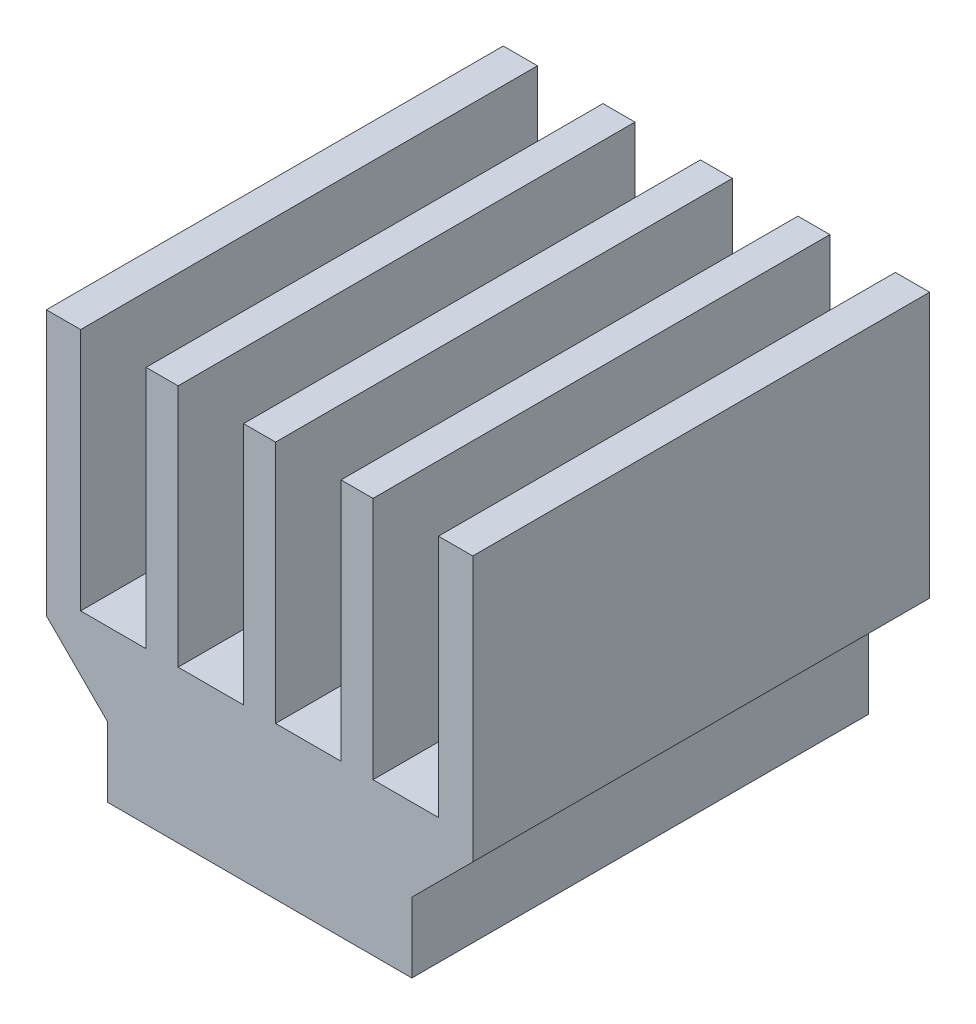
ISO-10303-21;
HEADER;
FILE_DESCRIPTION(('STEP AP214'),'2;1');
FILE_NAME('part.step','',(''),(''),'','','');
FILE_SCHEMA(('AUTOMOTIVE_DESIGN { 1 0 10303 214 1 1 1 1 }'));
ENDSEC;
DATA;
#1=APPLICATION_CONTEXT('core data for automotive mechanical design processes');
#2=APPLICATION_PROTOCOL_DEFINITION('international standard','automotive_design',2000,#1);
#3=PRODUCT_CONTEXT('',#1,'mechanical');
#4=PRODUCT('Part','Part','',(#3));
#5=PRODUCT_RELATED_PRODUCT_CATEGORY('part','',(#4));
#6=PRODUCT_DEFINITION_FORMATION('','',#4);
#7=PRODUCT_DEFINITION_CONTEXT('part definition',#1,'design');
#8=PRODUCT_DEFINITION('design','',#6,#7);
#9=PRODUCT_DEFINITION_SHAPE('','',#8);
#10=(LENGTH_UNIT() NAMED_UNIT(*) SI_UNIT(.MILLI.,.METRE.));
#11=(NAMED_UNIT(*) PLANE_ANGLE_UNIT() SI_UNIT($,.RADIAN.));
#12=(NAMED_UNIT(*) SI_UNIT($,.STERADIAN.) SOLID_ANGLE_UNIT());
#13=UNCERTAINTY_MEASURE_WITH_UNIT(LENGTH_MEASURE(1.E-05),#10,'distance_accuracy_value','');
#14=(GEOMETRIC_REPRESENTATION_CONTEXT(3) GLOBAL_UNCERTAINTY_ASSIGNED_CONTEXT((#13)) GLOBAL_UNIT_ASSIGNED_CONTEXT((#10,
#11,#12)) REPRESENTATION_CONTEXT('',''));
#15=CARTESIAN_POINT('',(0.,0.,0.));
#16=DIRECTION('',(0.,0.,1.));
#17=DIRECTION('',(1.,0.,0.));
#18=AXIS2_PLACEMENT_3D('',#15,#16,#17);
#19=CARTESIAN_POINT('',(-6.99999999999999,0.,15.0000000000001));
#20=DIRECTION('',(1.,0.,0.));
#21=DIRECTION('',(0.,1.,0.));
#22=AXIS2_PLACEMENT_3D('',#19,#20,#21);
#23=PLANE('',#22);
#24=DIRECTION('',(0.,-1.,0.));
#25=VECTOR('',#24,1.);
#26=CARTESIAN_POINT('',(-7.00000000000001,0.,0.));
#27=LINE('',#26,#25);
#28=CARTESIAN_POINT('',(-7.00000000000001,13.,0.));
#29=VERTEX_POINT('',#28);
#30=CARTESIAN_POINT('',(-7.00000000000001,4.3,0.));
#31=VERTEX_POINT('',#30);
#32=EDGE_CURVE('E229',#29,#31,#27,.T.);
#33=ORIENTED_EDGE('',*,*,#32,.T.);
#34=DIRECTION('',(0.,0.,-1.));
#35=VECTOR('',#34,1.);
#36=CARTESIAN_POINT('',(-6.99999999999999,4.3,15.));
#37=LINE('',#36,#35);
#38=CARTESIAN_POINT('',(-6.99999999999999,4.3,15.));
#39=VERTEX_POINT('',#38);
#40=EDGE_CURVE('E11',#39,#31,#37,.T.);
#41=ORIENTED_EDGE('',*,*,#40,.F.);
#42=DIRECTION('',(0.,-1.,0.));
#43=VECTOR('',#42,1.);
#44=CARTESIAN_POINT('',(-6.99999999999999,0.,15.0000000000001));
#45=LINE('',#44,#43);
#46=CARTESIAN_POINT('',(-6.99999999999999,13.,15.));
#47=VERTEX_POINT('',#46);
#48=EDGE_CURVE('E420',#47,#39,#45,.T.);
#49=ORIENTED_EDGE('',*,*,#48,.F.);
#50=DIRECTION('',(0.,0.,-1.));
#51=VECTOR('',#50,1.);
#52=CARTESIAN_POINT('',(-6.99999999999999,13.,15.));
#53=LINE('',#52,#51);
#54=EDGE_CURVE('E48',#47,#29,#53,.T.);
#55=ORIENTED_EDGE('',*,*,#54,.T.);
#56=EDGE_LOOP('',(#33,#41,#49,#55));
#57=FACE_BOUND('',#56,.T.);
#58=ADVANCED_FACE('F32',(#57),#23,.F.);
#59=CARTESIAN_POINT('',(-1.34999999999998,-1.34999999999999,15.));
#60=DIRECTION('',(0.707106781186546,0.707106781186549,0.));
#61=DIRECTION('',(-0.70710678118655,0.707106781186546,0.));
#62=AXIS2_PLACEMENT_3D('',#59,#60,#61);
#63=PLANE('',#62);
#64=DIRECTION('',(0.70710678118655,-0.707106781186546,0.));
#65=VECTOR('',#64,1.);
#66=CARTESIAN_POINT('',(-1.34999999999998,-1.34999999999999,0.));
#67=LINE('',#66,#65);
#68=CARTESIAN_POINT('',(-4.99999999999999,2.30000000000001,0.));
#69=VERTEX_POINT('',#68);
#70=EDGE_CURVE('E231',#31,#69,#67,.T.);
#71=ORIENTED_EDGE('',*,*,#70,.T.);
#72=DIRECTION('',(0.,0.,-1.));
#73=VECTOR('',#72,1.);
#74=CARTESIAN_POINT('',(-5.,2.30000000000001,15.0000000000001));
#75=LINE('',#74,#73);
#76=CARTESIAN_POINT('',(-5.,2.30000000000001,15.0000000000001));
#77=VERTEX_POINT('',#76);
#78=EDGE_CURVE('E40',#77,#69,#75,.T.);
#79=ORIENTED_EDGE('',*,*,#78,.F.);
#80=DIRECTION('',(0.70710678118655,-0.707106781186546,0.));
#81=VECTOR('',#80,1.);
#82=CARTESIAN_POINT('',(-1.34999999999998,-1.34999999999999,15.));
#83=LINE('',#82,#81);
#84=EDGE_CURVE('E134',#39,#77,#83,.T.);
#85=ORIENTED_EDGE('',*,*,#84,.F.);
#86=ORIENTED_EDGE('',*,*,#40,.T.);
#87=EDGE_LOOP('',(#71,#79,#85,#86));
#88=FACE_BOUND('',#87,.T.);
#89=ADVANCED_FACE('F423',(#88),#63,.F.);
#90=CARTESIAN_POINT('',(-5.,0.,15.0000000000001));
#91=DIRECTION('',(1.,0.,0.));
#92=DIRECTION('',(0.,1.,0.));
#93=AXIS2_PLACEMENT_3D('',#90,#91,#92);
#94=PLANE('',#93);
#95=DIRECTION('',(0.,-1.,0.));
#96=VECTOR('',#95,1.);
#97=CARTESIAN_POINT('',(-4.99999999999999,0.,0.));
#98=LINE('',#97,#96);
#99=CARTESIAN_POINT('',(-4.99999999999999,0.,0.));
#100=VERTEX_POINT('',#99);
#101=EDGE_CURVE('E233',#69,#100,#98,.T.);
#102=ORIENTED_EDGE('',*,*,#101,.T.);
#103=DIRECTION('',(0.,0.,-1.));
#104=VECTOR('',#103,1.);
#105=CARTESIAN_POINT('',(-5.,0.,15.0000000000001));
#106=LINE('',#105,#104);
#107=CARTESIAN_POINT('',(-5.,0.,15.0000000000001));
#108=VERTEX_POINT('',#107);
#109=EDGE_CURVE('E331',#108,#100,#106,.T.);
#110=ORIENTED_EDGE('',*,*,#109,.F.);
#111=DIRECTION('',(0.,-1.,0.));
#112=VECTOR('',#111,1.);
#113=CARTESIAN_POINT('',(-5.,0.,15.0000000000001));
#114=LINE('',#113,#112);
#115=EDGE_CURVE('E339',#77,#108,#114,.T.);
#116=ORIENTED_EDGE('',*,*,#115,.F.);
#117=ORIENTED_EDGE('',*,*,#78,.T.);
#118=EDGE_LOOP('',(#102,#110,#116,#117));
#119=FACE_BOUND('',#118,.T.);
#120=ADVANCED_FACE('F337',(#119),#94,.F.);
#121=CARTESIAN_POINT('',(0.,0.,15.));
#122=DIRECTION('',(0.,1.,0.));
#123=DIRECTION('',(0.,0.,1.));
#124=AXIS2_PLACEMENT_3D('',#121,#122,#123);
#125=PLANE('',#124);
#126=DIRECTION('',(1.,0.,0.));
#127=VECTOR('',#126,1.);
#128=CARTESIAN_POINT('',(0.,0.,0.));
#129=LINE('',#128,#127);
#130=CARTESIAN_POINT('',(5.00000000000003,0.,0.));
#131=VERTEX_POINT('',#130);
#132=EDGE_CURVE('E236',#100,#131,#129,.T.);
#133=ORIENTED_EDGE('',*,*,#132,.T.);
#134=DIRECTION('',(0.,0.,-1.));
#135=VECTOR('',#134,1.);
#136=CARTESIAN_POINT('',(5.,0.,15.));
#137=LINE('',#136,#135);
#138=CARTESIAN_POINT('',(5.,0.,15.));
#139=VERTEX_POINT('',#138);
#140=EDGE_CURVE('E328',#139,#131,#137,.T.);
#141=ORIENTED_EDGE('',*,*,#140,.F.);
#142=DIRECTION('',(1.,0.,0.));
#143=VECTOR('',#142,1.);
#144=CARTESIAN_POINT('',(0.,0.,15.));
#145=LINE('',#144,#143);
#146=EDGE_CURVE('E349',#108,#139,#145,.T.);
#147=ORIENTED_EDGE('',*,*,#146,.F.);
#148=ORIENTED_EDGE('',*,*,#109,.T.);
#149=EDGE_LOOP('',(#133,#141,#147,#148));
#150=FACE_BOUND('',#149,.T.);
#151=ADVANCED_FACE('F346',(#150),#125,.F.);
#152=CARTESIAN_POINT('',(5.,0.,15.));
#153=DIRECTION('',(1.,0.,0.));
#154=DIRECTION('',(0.,1.,0.));
#155=AXIS2_PLACEMENT_3D('',#152,#153,#154);
#156=PLANE('',#155);
#157=DIRECTION('',(0.,-1.,0.));
#158=VECTOR('',#157,1.);
#159=CARTESIAN_POINT('',(5.00000000000003,0.,0.));
#160=LINE('',#159,#158);
#161=CARTESIAN_POINT('',(5.00000000000003,2.30000000000001,0.));
#162=VERTEX_POINT('',#161);
#163=EDGE_CURVE('E239',#162,#131,#160,.T.);
#164=ORIENTED_EDGE('',*,*,#163,.F.);
#165=DIRECTION('',(0.,0.,-1.));
#166=VECTOR('',#165,1.);
#167=CARTESIAN_POINT('',(5.00000000000002,2.30000000000001,15.));
#168=LINE('',#167,#166);
#169=CARTESIAN_POINT('',(5.00000000000002,2.30000000000001,15.));
#170=VERTEX_POINT('',#169);
#171=EDGE_CURVE('E326',#170,#162,#168,.T.);
#172=ORIENTED_EDGE('',*,*,#171,.F.);
#173=DIRECTION('',(0.,-1.,0.));
#174=VECTOR('',#173,1.);
#175=CARTESIAN_POINT('',(5.,0.,15.));
#176=LINE('',#175,#174);
#177=EDGE_CURVE('E352',#170,#139,#176,.T.);
#178=ORIENTED_EDGE('',*,*,#177,.T.);
#179=ORIENTED_EDGE('',*,*,#140,.T.);
#180=EDGE_LOOP('',(#164,#172,#178,#179));
#181=FACE_BOUND('',#180,.T.);
#182=ADVANCED_FACE('F433',(#181),#156,.T.);
#183=CARTESIAN_POINT('',(1.34999999999999,-1.34999999999999,15.));
#184=DIRECTION('',(0.707106781186546,-0.707106781186549,0.));
#185=DIRECTION('',(0.70710678118655,0.707106781186546,0.));
#186=AXIS2_PLACEMENT_3D('',#183,#184,#185);
#187=PLANE('',#186);
#188=DIRECTION('',(-0.70710678118655,-0.707106781186546,0.));
#189=VECTOR('',#188,1.);
#190=CARTESIAN_POINT('',(1.34999999999999,-1.34999999999999,0.));
#191=LINE('',#190,#189);
#192=CARTESIAN_POINT('',(6.99999999999999,4.30000000000001,0.));
#193=VERTEX_POINT('',#192);
#194=EDGE_CURVE('E242',#193,#162,#191,.T.);
#195=ORIENTED_EDGE('',*,*,#194,.F.);
#196=DIRECTION('',(0.,0.,-1.));
#197=VECTOR('',#196,1.);
#198=CARTESIAN_POINT('',(7.00000000000002,4.3,15.));
#199=LINE('',#198,#197);
#200=CARTESIAN_POINT('',(7.00000000000002,4.3,15.));
#201=VERTEX_POINT('',#200);
#202=EDGE_CURVE('E323',#201,#193,#199,.T.);
#203=ORIENTED_EDGE('',*,*,#202,.F.);
#204=DIRECTION('',(-0.70710678118655,-0.707106781186546,0.));
#205=VECTOR('',#204,1.);
#206=CARTESIAN_POINT('',(1.34999999999999,-1.34999999999999,15.));
#207=LINE('',#206,#205);
#208=EDGE_CURVE('E356',#201,#170,#207,.T.);
#209=ORIENTED_EDGE('',*,*,#208,.T.);
#210=ORIENTED_EDGE('',*,*,#171,.T.);
#211=EDGE_LOOP('',(#195,#203,#209,#210));
#212=FACE_BOUND('',#211,.T.);
#213=ADVANCED_FACE('F436',(#212),#187,.T.);
#214=CARTESIAN_POINT('',(7.00000000000003,0.,15.));
#215=DIRECTION('',(1.,0.,0.));
#216=DIRECTION('',(0.,1.,0.));
#217=AXIS2_PLACEMENT_3D('',#214,#215,#216);
#218=PLANE('',#217);
#219=DIRECTION('',(0.,-1.,0.));
#220=VECTOR('',#219,1.);
#221=CARTESIAN_POINT('',(7.00000000000001,0.,0.));
#222=LINE('',#221,#220);
#223=CARTESIAN_POINT('',(6.99999999999999,13.,0.));
#224=VERTEX_POINT('',#223);
#225=EDGE_CURVE('E245',#224,#193,#222,.T.);
#226=ORIENTED_EDGE('',*,*,#225,.F.);
#227=DIRECTION('',(0.,0.,-1.));
#228=VECTOR('',#227,1.);
#229=CARTESIAN_POINT('',(7.00000000000002,13.,15.));
#230=LINE('',#229,#228);
#231=CARTESIAN_POINT('',(7.00000000000002,13.,15.));
#232=VERTEX_POINT('',#231);
#233=EDGE_CURVE('E321',#232,#224,#230,.T.);
#234=ORIENTED_EDGE('',*,*,#233,.F.);
#235=DIRECTION('',(0.,-1.,0.));
#236=VECTOR('',#235,1.);
#237=CARTESIAN_POINT('',(7.00000000000003,0.,15.));
#238=LINE('',#237,#236);
#239=EDGE_CURVE('E363',#232,#201,#238,.T.);
#240=ORIENTED_EDGE('',*,*,#239,.T.);
#241=ORIENTED_EDGE('',*,*,#202,.T.);
#242=EDGE_LOOP('',(#226,#234,#240,#241));
#243=FACE_BOUND('',#242,.T.);
#244=ADVANCED_FACE('F440',(#243),#218,.T.);
#245=CARTESIAN_POINT('',(0.,13.,15.));
#246=DIRECTION('',(0.,1.,0.));
#247=DIRECTION('',(0.,0.,1.));
#248=AXIS2_PLACEMENT_3D('',#245,#246,#247);
#249=PLANE('',#248);
#250=DIRECTION('',(1.,0.,0.));
#251=VECTOR('',#250,1.);
#252=CARTESIAN_POINT('',(0.,13.,0.));
#253=LINE('',#252,#251);
#254=CARTESIAN_POINT('',(5.87500000000001,13.,0.));
#255=VERTEX_POINT('',#254);
#256=EDGE_CURVE('E249',#255,#224,#253,.T.);
#257=ORIENTED_EDGE('',*,*,#256,.F.);
#258=DIRECTION('',(0.,0.,-1.));
#259=VECTOR('',#258,1.);
#260=CARTESIAN_POINT('',(5.87500000000001,13.,15.));
#261=LINE('',#260,#259);
#262=CARTESIAN_POINT('',(5.87500000000001,13.,15.));
#263=VERTEX_POINT('',#262);
#264=EDGE_CURVE('E319',#263,#255,#261,.T.);
#265=ORIENTED_EDGE('',*,*,#264,.F.);
#266=DIRECTION('',(1.,0.,0.));
#267=VECTOR('',#266,1.);
#268=CARTESIAN_POINT('',(0.,13.,15.));
#269=LINE('',#268,#267);
#270=EDGE_CURVE('E226',#263,#232,#269,.T.);
#271=ORIENTED_EDGE('',*,*,#270,.T.);
#272=ORIENTED_EDGE('',*,*,#233,.T.);
#273=EDGE_LOOP('',(#257,#265,#271,#272));
#274=FACE_BOUND('',#273,.T.);
#275=ADVANCED_FACE('F444',(#274),#249,.T.);
#276=CARTESIAN_POINT('',(5.87500000000001,0.,15.));
#277=DIRECTION('',(1.,0.,0.));
#278=DIRECTION('',(0.,1.,0.));
#279=AXIS2_PLACEMENT_3D('',#276,#277,#278);
#280=PLANE('',#279);
#281=DIRECTION('',(0.,-1.,0.));
#282=VECTOR('',#281,1.);
#283=CARTESIAN_POINT('',(5.87500000000001,0.,0.));
#284=LINE('',#283,#282);
#285=CARTESIAN_POINT('',(5.87500000000001,5.,0.));
#286=VERTEX_POINT('',#285);
#287=EDGE_CURVE('E252',#255,#286,#284,.T.);
#288=ORIENTED_EDGE('',*,*,#287,.T.);
#289=DIRECTION('',(0.,0.,-1.));
#290=VECTOR('',#289,1.);
#291=CARTESIAN_POINT('',(5.87500000000001,5.,15.));
#292=LINE('',#291,#290);
#293=CARTESIAN_POINT('',(5.87500000000001,5.,15.));
#294=VERTEX_POINT('',#293);
#295=EDGE_CURVE('E316',#294,#286,#292,.T.);
#296=ORIENTED_EDGE('',*,*,#295,.F.);
#297=DIRECTION('',(0.,-1.,0.));
#298=VECTOR('',#297,1.);
#299=CARTESIAN_POINT('',(5.87500000000001,0.,15.));
#300=LINE('',#299,#298);
#301=EDGE_CURVE('E367',#263,#294,#300,.T.);
#302=ORIENTED_EDGE('',*,*,#301,.F.);
#303=ORIENTED_EDGE('',*,*,#264,.T.);
#304=EDGE_LOOP('',(#288,#296,#302,#303));
#305=FACE_BOUND('',#304,.T.);
#306=ADVANCED_FACE('F446',(#305),#280,.F.);
#307=CARTESIAN_POINT('',(0.,5.,15.));
#308=DIRECTION('',(0.,1.,0.));
#309=DIRECTION('',(0.,0.,1.));
#310=AXIS2_PLACEMENT_3D('',#307,#308,#309);
#311=PLANE('',#310);
#312=DIRECTION('',(1.,0.,0.));
#313=VECTOR('',#312,1.);
#314=CARTESIAN_POINT('',(0.,5.,0.));
#315=LINE('',#314,#313);
#316=CARTESIAN_POINT('',(3.72500000000001,5.,0.));
#317=VERTEX_POINT('',#316);
#318=EDGE_CURVE('E257',#317,#286,#315,.T.);
#319=ORIENTED_EDGE('',*,*,#318,.F.);
#320=DIRECTION('',(0.,0.,-1.));
#321=VECTOR('',#320,1.);
#322=CARTESIAN_POINT('',(3.72500000000001,5.,15.));
#323=LINE('',#322,#321);
#324=CARTESIAN_POINT('',(3.72500000000001,5.,15.));
#325=VERTEX_POINT('',#324);
#326=EDGE_CURVE('E314',#325,#317,#323,.T.);
#327=ORIENTED_EDGE('',*,*,#326,.F.);
#328=DIRECTION('',(1.,0.,0.));
#329=VECTOR('',#328,1.);
#330=CARTESIAN_POINT('',(0.,5.,15.));
#331=LINE('',#330,#329);
#332=EDGE_CURVE('E370',#325,#294,#331,.T.);
#333=ORIENTED_EDGE('',*,*,#332,.T.);
#334=ORIENTED_EDGE('',*,*,#295,.T.);
#335=EDGE_LOOP('',(#319,#327,#333,#334));
#336=FACE_BOUND('',#335,.T.);
#337=ADVANCED_FACE('F449',(#336),#311,.T.);
#338=CARTESIAN_POINT('',(3.72499999999999,0.,15.));
#339=DIRECTION('',(1.,0.,0.));
#340=DIRECTION('',(0.,1.,0.));
#341=AXIS2_PLACEMENT_3D('',#338,#339,#340);
#342=PLANE('',#341);
#343=DIRECTION('',(0.,-1.,0.));
#344=VECTOR('',#343,1.);
#345=CARTESIAN_POINT('',(3.72500000000001,0.,0.));
#346=LINE('',#345,#344);
#347=CARTESIAN_POINT('',(3.72500000000001,13.,0.));
#348=VERTEX_POINT('',#347);
#349=EDGE_CURVE('E260',#348,#317,#346,.T.);
#350=ORIENTED_EDGE('',*,*,#349,.F.);
#351=DIRECTION('',(0.,0.,-1.));
#352=VECTOR('',#351,1.);
#353=CARTESIAN_POINT('',(3.72500000000001,13.,15.));
#354=LINE('',#353,#352);
#355=CARTESIAN_POINT('',(3.72500000000001,13.,15.));
#356=VERTEX_POINT('',#355);
#357=EDGE_CURVE('E312',#356,#348,#354,.T.);
#358=ORIENTED_EDGE('',*,*,#357,.F.);
#359=DIRECTION('',(0.,-1.,0.));
#360=VECTOR('',#359,1.);
#361=CARTESIAN_POINT('',(3.72499999999999,0.,15.));
#362=LINE('',#361,#360);
#363=EDGE_CURVE('E373',#356,#325,#362,.T.);
#364=ORIENTED_EDGE('',*,*,#363,.T.);
#365=ORIENTED_EDGE('',*,*,#326,.T.);
#366=EDGE_LOOP('',(#350,#358,#364,#365));
#367=FACE_BOUND('',#366,.T.);
#368=ADVANCED_FACE('F409',(#367),#342,.T.);
#369=CARTESIAN_POINT('',(2.675,13.,0.));
#370=VERTEX_POINT('',#369);
#371=EDGE_CURVE('E254',#370,#348,#253,.T.);
#372=ORIENTED_EDGE('',*,*,#371,.F.);
#373=DIRECTION('',(0.,0.,-1.));
#374=VECTOR('',#373,1.);
#375=CARTESIAN_POINT('',(2.67500000000002,13.,15.));
#376=LINE('',#375,#374);
#377=CARTESIAN_POINT('',(2.67500000000002,13.,15.));
#378=VERTEX_POINT('',#377);
#379=EDGE_CURVE('E310',#378,#370,#376,.T.);
#380=ORIENTED_EDGE('',*,*,#379,.F.);
#381=EDGE_CURVE('E368',#378,#356,#269,.T.);
#382=ORIENTED_EDGE('',*,*,#381,.T.);
#383=ORIENTED_EDGE('',*,*,#357,.T.);
#384=EDGE_LOOP('',(#372,#380,#382,#383));
#385=FACE_BOUND('',#384,.T.);
#386=ADVANCED_FACE('F401',(#385),#249,.T.);
#387=CARTESIAN_POINT('',(2.67500000000002,0.,15.));
#388=DIRECTION('',(1.,0.,0.));
#389=DIRECTION('',(0.,1.,0.));
#390=AXIS2_PLACEMENT_3D('',#387,#388,#389);
#391=PLANE('',#390);
#392=DIRECTION('',(0.,-1.,0.));
#393=VECTOR('',#392,1.);
#394=CARTESIAN_POINT('',(2.67500000000001,0.,0.));
#395=LINE('',#394,#393);
#396=CARTESIAN_POINT('',(2.67500000000001,5.,0.));
#397=VERTEX_POINT('',#396);
#398=EDGE_CURVE('E264',#370,#397,#395,.T.);
#399=ORIENTED_EDGE('',*,*,#398,.T.);
#400=DIRECTION('',(0.,0.,-1.));
#401=VECTOR('',#400,1.);
#402=CARTESIAN_POINT('',(2.67500000000002,5.,15.));
#403=LINE('',#402,#401);
#404=CARTESIAN_POINT('',(2.67500000000002,5.,15.));
#405=VERTEX_POINT('',#404);
#406=EDGE_CURVE('E307',#405,#397,#403,.T.);
#407=ORIENTED_EDGE('',*,*,#406,.F.);
#408=DIRECTION('',(0.,-1.,0.));
#409=VECTOR('',#408,1.);
#410=CARTESIAN_POINT('',(2.67500000000002,0.,15.));
#411=LINE('',#410,#409);
#412=EDGE_CURVE('E376',#378,#405,#411,.T.);
#413=ORIENTED_EDGE('',*,*,#412,.F.);
#414=ORIENTED_EDGE('',*,*,#379,.T.);
#415=EDGE_LOOP('',(#399,#407,#413,#414));
#416=FACE_BOUND('',#415,.T.);
#417=ADVANCED_FACE('F456',(#416),#391,.F.);
#418=CARTESIAN_POINT('',(0.,5.,15.));
#419=DIRECTION('',(0.,1.,0.));
#420=DIRECTION('',(0.,0.,1.));
#421=AXIS2_PLACEMENT_3D('',#418,#419,#420);
#422=PLANE('',#421);
#423=DIRECTION('',(1.,0.,0.));
#424=VECTOR('',#423,1.);
#425=CARTESIAN_POINT('',(0.,5.,0.));
#426=LINE('',#425,#424);
#427=CARTESIAN_POINT('',(0.524999999999998,5.,0.));
#428=VERTEX_POINT('',#427);
#429=EDGE_CURVE('E267',#428,#397,#426,.T.);
#430=ORIENTED_EDGE('',*,*,#429,.F.);
#431=DIRECTION('',(0.,0.,-1.));
#432=VECTOR('',#431,1.);
#433=CARTESIAN_POINT('',(0.525000000000012,5.,15.));
#434=LINE('',#433,#432);
#435=CARTESIAN_POINT('',(0.525000000000012,5.,15.));
#436=VERTEX_POINT('',#435);
#437=EDGE_CURVE('E305',#436,#428,#434,.T.);
#438=ORIENTED_EDGE('',*,*,#437,.F.);
#439=DIRECTION('',(1.,0.,0.));
#440=VECTOR('',#439,1.);
#441=CARTESIAN_POINT('',(0.,5.,15.));
#442=LINE('',#441,#440);
#443=EDGE_CURVE('E378',#436,#405,#442,.T.);
#444=ORIENTED_EDGE('',*,*,#443,.T.);
#445=ORIENTED_EDGE('',*,*,#406,.T.);
#446=EDGE_LOOP('',(#430,#438,#444,#445));
#447=FACE_BOUND('',#446,.T.);
#448=ADVANCED_FACE('F459',(#447),#422,.T.);
#449=CARTESIAN_POINT('',(0.525000000000012,0.,15.));
#450=DIRECTION('',(1.,0.,0.));
#451=DIRECTION('',(0.,1.,0.));
#452=AXIS2_PLACEMENT_3D('',#449,#450,#451);
#453=PLANE('',#452);
#454=DIRECTION('',(0.,-1.,0.));
#455=VECTOR('',#454,1.);
#456=CARTESIAN_POINT('',(0.524999999999998,0.,0.));
#457=LINE('',#456,#455);
#458=CARTESIAN_POINT('',(0.524999999999998,13.,0.));
#459=VERTEX_POINT('',#458);
#460=EDGE_CURVE('E270',#459,#428,#457,.T.);
#461=ORIENTED_EDGE('',*,*,#460,.F.);
#462=DIRECTION('',(0.,0.,-1.));
#463=VECTOR('',#462,1.);
#464=CARTESIAN_POINT('',(0.525000000000012,13.,15.));
#465=LINE('',#464,#463);
#466=CARTESIAN_POINT('',(0.525000000000012,13.,15.));
#467=VERTEX_POINT('',#466);
#468=EDGE_CURVE('E303',#467,#459,#465,.T.);
#469=ORIENTED_EDGE('',*,*,#468,.F.);
#470=DIRECTION('',(0.,-1.,0.));
#471=VECTOR('',#470,1.);
#472=CARTESIAN_POINT('',(0.525000000000012,0.,15.));
#473=LINE('',#472,#471);
#474=EDGE_CURVE('E382',#467,#436,#473,.T.);
#475=ORIENTED_EDGE('',*,*,#474,.T.);
#476=ORIENTED_EDGE('',*,*,#437,.T.);
#477=EDGE_LOOP('',(#461,#469,#475,#476));
#478=FACE_BOUND('',#477,.T.);
#479=ADVANCED_FACE('F463',(#478),#453,.T.);
#480=CARTESIAN_POINT('',(-0.524999999999998,13.,0.));
#481=VERTEX_POINT('',#480);
#482=EDGE_CURVE('E273',#481,#459,#253,.T.);
#483=ORIENTED_EDGE('',*,*,#482,.F.);
#484=DIRECTION('',(0.,0.,-1.));
#485=VECTOR('',#484,1.);
#486=CARTESIAN_POINT('',(-0.524999999999998,13.,15.));
#487=LINE('',#486,#485);
#488=CARTESIAN_POINT('',(-0.524999999999998,13.,15.));
#489=VERTEX_POINT('',#488);
#490=EDGE_CURVE('E301',#489,#481,#487,.T.);
#491=ORIENTED_EDGE('',*,*,#490,.F.);
#492=EDGE_CURVE('E385',#489,#467,#269,.T.);
#493=ORIENTED_EDGE('',*,*,#492,.T.);
#494=ORIENTED_EDGE('',*,*,#468,.T.);
#495=EDGE_LOOP('',(#483,#491,#493,#494));
#496=FACE_BOUND('',#495,.T.);
#497=ADVANCED_FACE('F467',(#496),#249,.T.);
#498=CARTESIAN_POINT('',(-0.524999999999998,0.,15.));
#499=DIRECTION('',(1.,0.,0.));
#500=DIRECTION('',(0.,1.,0.));
#501=AXIS2_PLACEMENT_3D('',#498,#499,#500);
#502=PLANE('',#501);
#503=DIRECTION('',(0.,-1.,0.));
#504=VECTOR('',#503,1.);
#505=CARTESIAN_POINT('',(-0.524999999999998,0.,0.));
#506=LINE('',#505,#504);
#507=CARTESIAN_POINT('',(-0.524999999999998,5.,0.));
#508=VERTEX_POINT('',#507);
#509=EDGE_CURVE('E274',#481,#508,#506,.T.);
#510=ORIENTED_EDGE('',*,*,#509,.T.);
#511=DIRECTION('',(0.,0.,-1.));
#512=VECTOR('',#511,1.);
#513=CARTESIAN_POINT('',(-0.524999999999998,5.,15.));
#514=LINE('',#513,#512);
#515=CARTESIAN_POINT('',(-0.524999999999998,5.,15.));
#516=VERTEX_POINT('',#515);
#517=EDGE_CURVE('E298',#516,#508,#514,.T.);
#518=ORIENTED_EDGE('',*,*,#517,.F.);
#519=DIRECTION('',(0.,-1.,0.));
#520=VECTOR('',#519,1.);
#521=CARTESIAN_POINT('',(-0.524999999999998,0.,15.));
#522=LINE('',#521,#520);
#523=EDGE_CURVE('E386',#489,#516,#522,.T.);
#524=ORIENTED_EDGE('',*,*,#523,.F.);
#525=ORIENTED_EDGE('',*,*,#490,.T.);
#526=EDGE_LOOP('',(#510,#518,#524,#525));
#527=FACE_BOUND('',#526,.T.);
#528=ADVANCED_FACE('F469',(#527),#502,.F.);
#529=CARTESIAN_POINT('',(0.,5.,15.));
#530=DIRECTION('',(0.,-1.,0.));
#531=DIRECTION('',(0.,0.,-1.));
#532=AXIS2_PLACEMENT_3D('',#529,#530,#531);
#533=PLANE('',#532);
#534=DIRECTION('',(-1.,0.,0.));
#535=VECTOR('',#534,1.);
#536=CARTESIAN_POINT('',(0.,5.,0.));
#537=LINE('',#536,#535);
#538=CARTESIAN_POINT('',(-2.67500000000001,5.,0.));
#539=VERTEX_POINT('',#538);
#540=EDGE_CURVE('E276',#508,#539,#537,.T.);
#541=ORIENTED_EDGE('',*,*,#540,.T.);
#542=DIRECTION('',(0.,0.,-1.));
#543=VECTOR('',#542,1.);
#544=CARTESIAN_POINT('',(-2.67499999999998,5.,15.));
#545=LINE('',#544,#543);
#546=CARTESIAN_POINT('',(-2.67499999999998,5.,15.));
#547=VERTEX_POINT('',#546);
#548=EDGE_CURVE('E296',#547,#539,#545,.T.);
#549=ORIENTED_EDGE('',*,*,#548,.F.);
#550=DIRECTION('',(-1.,0.,0.));
#551=VECTOR('',#550,1.);
#552=CARTESIAN_POINT('',(0.,5.,15.));
#553=LINE('',#552,#551);
#554=EDGE_CURVE('E388',#516,#547,#553,.T.);
#555=ORIENTED_EDGE('',*,*,#554,.F.);
#556=ORIENTED_EDGE('',*,*,#517,.T.);
#557=EDGE_LOOP('',(#541,#549,#555,#556));
#558=FACE_BOUND('',#557,.T.);
#559=ADVANCED_FACE('F472',(#558),#533,.F.);
#560=CARTESIAN_POINT('',(-2.67499999999998,0.,15.));
#561=DIRECTION('',(1.,0.,0.));
#562=DIRECTION('',(0.,1.,0.));
#563=AXIS2_PLACEMENT_3D('',#560,#561,#562);
#564=PLANE('',#563);
#565=DIRECTION('',(0.,-1.,0.));
#566=VECTOR('',#565,1.);
#567=CARTESIAN_POINT('',(-2.67500000000001,0.,0.));
#568=LINE('',#567,#566);
#569=CARTESIAN_POINT('',(-2.67500000000002,13.,0.));
#570=VERTEX_POINT('',#569);
#571=EDGE_CURVE('E279',#570,#539,#568,.T.);
#572=ORIENTED_EDGE('',*,*,#571,.F.);
#573=DIRECTION('',(0.,0.,-1.));
#574=VECTOR('',#573,1.);
#575=CARTESIAN_POINT('',(-2.67499999999998,13.,15.));
#576=LINE('',#575,#574);
#577=CARTESIAN_POINT('',(-2.67499999999998,13.,15.));
#578=VERTEX_POINT('',#577);
#579=EDGE_CURVE('E294',#578,#570,#576,.T.);
#580=ORIENTED_EDGE('',*,*,#579,.F.);
#581=DIRECTION('',(0.,-1.,0.));
#582=VECTOR('',#581,1.);
#583=CARTESIAN_POINT('',(-2.67499999999998,0.,15.));
#584=LINE('',#583,#582);
#585=EDGE_CURVE('E390',#578,#547,#584,.T.);
#586=ORIENTED_EDGE('',*,*,#585,.T.);
#587=ORIENTED_EDGE('',*,*,#548,.T.);
#588=EDGE_LOOP('',(#572,#580,#586,#587));
#589=FACE_BOUND('',#588,.T.);
#590=ADVANCED_FACE('F476',(#589),#564,.T.);
#591=CARTESIAN_POINT('',(-3.72499999999999,13.,0.));
#592=VERTEX_POINT('',#591);
#593=EDGE_CURVE('E282',#592,#570,#253,.T.);
#594=ORIENTED_EDGE('',*,*,#593,.F.);
#595=DIRECTION('',(0.,0.,-1.));
#596=VECTOR('',#595,1.);
#597=CARTESIAN_POINT('',(-3.72500000000001,13.,15.));
#598=LINE('',#597,#596);
#599=CARTESIAN_POINT('',(-3.72500000000001,13.,15.));
#600=VERTEX_POINT('',#599);
#601=EDGE_CURVE('E292',#600,#592,#598,.T.);
#602=ORIENTED_EDGE('',*,*,#601,.F.);
#603=EDGE_CURVE('E225',#600,#578,#269,.T.);
#604=ORIENTED_EDGE('',*,*,#603,.T.);
#605=ORIENTED_EDGE('',*,*,#579,.T.);
#606=EDGE_LOOP('',(#594,#602,#604,#605));
#607=FACE_BOUND('',#606,.T.);
#608=ADVANCED_FACE('F480',(#607),#249,.T.);
#609=CARTESIAN_POINT('',(-3.72500000000001,0.,15.0000000000001));
#610=DIRECTION('',(1.,0.,0.));
#611=DIRECTION('',(0.,1.,0.));
#612=AXIS2_PLACEMENT_3D('',#609,#610,#611);
#613=PLANE('',#612);
#614=DIRECTION('',(0.,-1.,0.));
#615=VECTOR('',#614,1.);
#616=CARTESIAN_POINT('',(-3.72499999999999,0.,0.));
#617=LINE('',#616,#615);
#618=CARTESIAN_POINT('',(-3.72499999999999,5.,0.));
#619=VERTEX_POINT('',#618);
#620=EDGE_CURVE('E283',#592,#619,#617,.T.);
#621=ORIENTED_EDGE('',*,*,#620,.T.);
#622=DIRECTION('',(0.,0.,-1.));
#623=VECTOR('',#622,1.);
#624=CARTESIAN_POINT('',(-3.72500000000001,5.,15.));
#625=LINE('',#624,#623);
#626=CARTESIAN_POINT('',(-3.72500000000001,5.,15.));
#627=VERTEX_POINT('',#626);
#628=EDGE_CURVE('E219',#627,#619,#625,.T.);
#629=ORIENTED_EDGE('',*,*,#628,.F.);
#630=DIRECTION('',(0.,-1.,0.));
#631=VECTOR('',#630,1.);
#632=CARTESIAN_POINT('',(-3.72500000000001,0.,15.0000000000001));
#633=LINE('',#632,#631);
#634=EDGE_CURVE('E206',#600,#627,#633,.T.);
#635=ORIENTED_EDGE('',*,*,#634,.F.);
#636=ORIENTED_EDGE('',*,*,#601,.T.);
#637=EDGE_LOOP('',(#621,#629,#635,#636));
#638=FACE_BOUND('',#637,.T.);
#639=ADVANCED_FACE('F482',(#638),#613,.F.);
#640=CARTESIAN_POINT('',(0.,5.,15.));
#641=DIRECTION('',(0.,-1.,0.));
#642=DIRECTION('',(0.,0.,-1.));
#643=AXIS2_PLACEMENT_3D('',#640,#641,#642);
#644=PLANE('',#643);
#645=DIRECTION('',(-1.,0.,0.));
#646=VECTOR('',#645,1.);
#647=CARTESIAN_POINT('',(0.,5.,0.));
#648=LINE('',#647,#646);
#649=CARTESIAN_POINT('',(-5.87500000000001,5.,0.));
#650=VERTEX_POINT('',#649);
#651=EDGE_CURVE('E216',#619,#650,#648,.T.);
#652=ORIENTED_EDGE('',*,*,#651,.T.);
#653=DIRECTION('',(0.,0.,-1.));
#654=VECTOR('',#653,1.);
#655=CARTESIAN_POINT('',(-5.87500000000001,5.,15.));
#656=LINE('',#655,#654);
#657=CARTESIAN_POINT('',(-5.87500000000001,5.,15.));
#658=VERTEX_POINT('',#657);
#659=EDGE_CURVE('E213',#658,#650,#656,.T.);
#660=ORIENTED_EDGE('',*,*,#659,.F.);
#661=DIRECTION('',(-1.,0.,0.));
#662=VECTOR('',#661,1.);
#663=CARTESIAN_POINT('',(0.,5.,15.));
#664=LINE('',#663,#662);
#665=EDGE_CURVE('E198',#627,#658,#664,.T.);
#666=ORIENTED_EDGE('',*,*,#665,.F.);
#667=ORIENTED_EDGE('',*,*,#628,.T.);
#668=EDGE_LOOP('',(#652,#660,#666,#667));
#669=FACE_BOUND('',#668,.T.);
#670=ADVANCED_FACE('F214',(#669),#644,.F.);
#671=CARTESIAN_POINT('',(-5.87500000000001,0.,15.));
#672=DIRECTION('',(1.,0.,0.));
#673=DIRECTION('',(0.,1.,0.));
#674=AXIS2_PLACEMENT_3D('',#671,#672,#673);
#675=PLANE('',#674);
#676=DIRECTION('',(0.,-1.,0.));
#677=VECTOR('',#676,1.);
#678=CARTESIAN_POINT('',(-5.87500000000001,0.,0.));
#679=LINE('',#678,#677);
#680=CARTESIAN_POINT('',(-5.87500000000001,13.,0.));
#681=VERTEX_POINT('',#680);
#682=EDGE_CURVE('E286',#681,#650,#679,.T.);
#683=ORIENTED_EDGE('',*,*,#682,.F.);
#684=DIRECTION('',(0.,0.,-1.));
#685=VECTOR('',#684,1.);
#686=CARTESIAN_POINT('',(-5.87500000000001,13.,15.));
#687=LINE('',#686,#685);
#688=CARTESIAN_POINT('',(-5.87500000000001,13.,15.));
#689=VERTEX_POINT('',#688);
#690=EDGE_CURVE('E122',#689,#681,#687,.T.);
#691=ORIENTED_EDGE('',*,*,#690,.F.);
#692=DIRECTION('',(0.,-1.,0.));
#693=VECTOR('',#692,1.);
#694=CARTESIAN_POINT('',(-5.87500000000001,0.,15.));
#695=LINE('',#694,#693);
#696=EDGE_CURVE('E203',#689,#658,#695,.T.);
#697=ORIENTED_EDGE('',*,*,#696,.T.);
#698=ORIENTED_EDGE('',*,*,#659,.T.);
#699=EDGE_LOOP('',(#683,#691,#697,#698));
#700=FACE_BOUND('',#699,.T.);
#701=ADVANCED_FACE('F221',(#700),#675,.T.);
#702=EDGE_CURVE('E253',#29,#681,#253,.T.);
#703=ORIENTED_EDGE('',*,*,#702,.F.);
#704=ORIENTED_EDGE('',*,*,#54,.F.);
#705=EDGE_CURVE('E222',#47,#689,#269,.T.);
#706=ORIENTED_EDGE('',*,*,#705,.T.);
#707=ORIENTED_EDGE('',*,*,#690,.T.);
#708=EDGE_LOOP('',(#703,#704,#706,#707));
#709=FACE_BOUND('',#708,.T.);
#710=ADVANCED_FACE('F490',(#709),#249,.T.);
#711=CARTESIAN_POINT('',(0.,0.,15.));
#712=DIRECTION('',(0.,0.,1.));
#713=DIRECTION('',(1.,0.,0.));
#714=AXIS2_PLACEMENT_3D('',#711,#712,#713);
#715=PLANE('',#714);
#716=ORIENTED_EDGE('',*,*,#48,.T.);
#717=ORIENTED_EDGE('',*,*,#84,.T.);
#718=ORIENTED_EDGE('',*,*,#115,.T.);
#719=ORIENTED_EDGE('',*,*,#146,.T.);
#720=ORIENTED_EDGE('',*,*,#177,.F.);
#721=ORIENTED_EDGE('',*,*,#208,.F.);
#722=ORIENTED_EDGE('',*,*,#239,.F.);
#723=ORIENTED_EDGE('',*,*,#270,.F.);
#724=ORIENTED_EDGE('',*,*,#301,.T.);
#725=ORIENTED_EDGE('',*,*,#332,.F.);
#726=ORIENTED_EDGE('',*,*,#363,.F.);
#727=ORIENTED_EDGE('',*,*,#381,.F.);
#728=ORIENTED_EDGE('',*,*,#412,.T.);
#729=ORIENTED_EDGE('',*,*,#443,.F.);
#730=ORIENTED_EDGE('',*,*,#474,.F.);
#731=ORIENTED_EDGE('',*,*,#492,.F.);
#732=ORIENTED_EDGE('',*,*,#523,.T.);
#733=ORIENTED_EDGE('',*,*,#554,.T.);
#734=ORIENTED_EDGE('',*,*,#585,.F.);
#735=ORIENTED_EDGE('',*,*,#603,.F.);
#736=ORIENTED_EDGE('',*,*,#634,.T.);
#737=ORIENTED_EDGE('',*,*,#665,.T.);
#738=ORIENTED_EDGE('',*,*,#696,.F.);
#739=ORIENTED_EDGE('',*,*,#705,.F.);
#740=EDGE_LOOP('',(#716,#717,#718,#719,#720,#721,#722,#723,#724,#725,#726,#727,#728,#729,#730,
#731,#732,#733,#734,#735,#736,#737,#738,#739));
#741=FACE_BOUND('',#740,.T.);
#742=ADVANCED_FACE('F200',(#741),#715,.T.);
#743=CARTESIAN_POINT('',(0.,0.,0.));
#744=DIRECTION('',(0.,0.,1.));
#745=DIRECTION('',(1.,0.,0.));
#746=AXIS2_PLACEMENT_3D('',#743,#744,#745);
#747=PLANE('',#746);
#748=ORIENTED_EDGE('',*,*,#32,.F.);
#749=ORIENTED_EDGE('',*,*,#702,.T.);
#750=ORIENTED_EDGE('',*,*,#682,.T.);
#751=ORIENTED_EDGE('',*,*,#651,.F.);
#752=ORIENTED_EDGE('',*,*,#620,.F.);
#753=ORIENTED_EDGE('',*,*,#593,.T.);
#754=ORIENTED_EDGE('',*,*,#571,.T.);
#755=ORIENTED_EDGE('',*,*,#540,.F.);
#756=ORIENTED_EDGE('',*,*,#509,.F.);
#757=ORIENTED_EDGE('',*,*,#482,.T.);
#758=ORIENTED_EDGE('',*,*,#460,.T.);
#759=ORIENTED_EDGE('',*,*,#429,.T.);
#760=ORIENTED_EDGE('',*,*,#398,.F.);
#761=ORIENTED_EDGE('',*,*,#371,.T.);
#762=ORIENTED_EDGE('',*,*,#349,.T.);
#763=ORIENTED_EDGE('',*,*,#318,.T.);
#764=ORIENTED_EDGE('',*,*,#287,.F.);
#765=ORIENTED_EDGE('',*,*,#256,.T.);
#766=ORIENTED_EDGE('',*,*,#225,.T.);
#767=ORIENTED_EDGE('',*,*,#194,.T.);
#768=ORIENTED_EDGE('',*,*,#163,.T.);
#769=ORIENTED_EDGE('',*,*,#132,.F.);
#770=ORIENTED_EDGE('',*,*,#101,.F.);
#771=ORIENTED_EDGE('',*,*,#70,.F.);
#772=EDGE_LOOP('',(#748,#749,#750,#751,#752,#753,#754,#755,#756,#757,#758,#759,#760,#761,#762,
#763,#764,#765,#766,#767,#768,#769,#770,#771));
#773=FACE_BOUND('',#772,.T.);
#774=ADVANCED_FACE('F342',(#773),#747,.F.);
#775=CLOSED_SHELL('',(#58,#89,#120,#151,#182,#213,#244,#275,#306,#337,#368,#386,#417,#448,#479,
#497,#528,#559,#590,#608,#639,#670,#701,#710,#742,#774));
#776=MANIFOLD_SOLID_BREP('B2',#775);
#777=ADVANCED_BREP_SHAPE_REPRESENTATION('',(#18,#776),#14);
#778=SHAPE_DEFINITION_REPRESENTATION(#9,#777);
ENDSEC;
END-ISO-10303-21;
